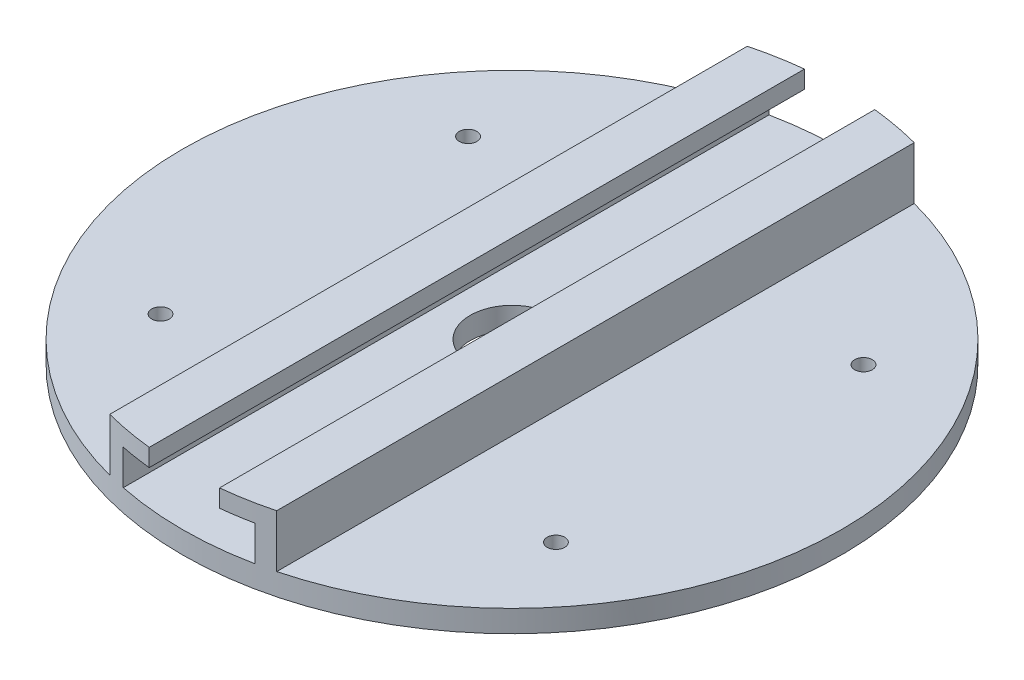
ISO-10303-21;
HEADER;
FILE_DESCRIPTION(('STEP AP214'),'2;1');
FILE_NAME('part.step','',(''),(''),'','','');
FILE_SCHEMA(('AUTOMOTIVE_DESIGN { 1 0 10303 214 1 1 1 1 }'));
ENDSEC;
DATA;
#1=APPLICATION_CONTEXT('core data for automotive mechanical design processes');
#2=APPLICATION_PROTOCOL_DEFINITION('international standard','automotive_design',2000,#1);
#3=PRODUCT_CONTEXT('',#1,'mechanical');
#4=PRODUCT('Part','Part','',(#3));
#5=PRODUCT_RELATED_PRODUCT_CATEGORY('part','',(#4));
#6=PRODUCT_DEFINITION_FORMATION('','',#4);
#7=PRODUCT_DEFINITION_CONTEXT('part definition',#1,'design');
#8=PRODUCT_DEFINITION('design','',#6,#7);
#9=PRODUCT_DEFINITION_SHAPE('','',#8);
#10=(LENGTH_UNIT() NAMED_UNIT(*) SI_UNIT(.MILLI.,.METRE.));
#11=(NAMED_UNIT(*) PLANE_ANGLE_UNIT() SI_UNIT($,.RADIAN.));
#12=(NAMED_UNIT(*) SI_UNIT($,.STERADIAN.) SOLID_ANGLE_UNIT());
#13=UNCERTAINTY_MEASURE_WITH_UNIT(LENGTH_MEASURE(1.E-05),#10,'distance_accuracy_value','');
#14=(GEOMETRIC_REPRESENTATION_CONTEXT(3) GLOBAL_UNCERTAINTY_ASSIGNED_CONTEXT((#13)) GLOBAL_UNIT_ASSIGNED_CONTEXT((#10,
#11,#12)) REPRESENTATION_CONTEXT('',''));
#15=CARTESIAN_POINT('',(0.,0.,0.));
#16=DIRECTION('',(0.,0.,1.));
#17=DIRECTION('',(1.,0.,0.));
#18=AXIS2_PLACEMENT_3D('',#15,#16,#17);
#19=CARTESIAN_POINT('',(0.,5.,0.));
#20=DIRECTION('',(0.,1.,0.));
#21=DIRECTION('',(0.,0.,1.));
#22=AXIS2_PLACEMENT_3D('',#19,#20,#21);
#23=PLANE('',#22);
#24=CARTESIAN_POINT('',(45.,5.,35.));
#25=DIRECTION('',(0.,1.,0.));
#26=DIRECTION('',(0.,0.,1.));
#27=AXIS2_PLACEMENT_3D('',#24,#25,#26);
#28=CIRCLE('',#27,2.);
#29=CARTESIAN_POINT('',(45.,5.,37.));
#30=VERTEX_POINT('',#29);
#31=EDGE_CURVE('E268',#30,#30,#28,.T.);
#32=ORIENTED_EDGE('',*,*,#31,.F.);
#33=EDGE_LOOP('',(#32));
#34=FACE_BOUND('',#33,.T.);
#35=CARTESIAN_POINT('',(45.,5.,-35.));
#36=DIRECTION('',(0.,1.,0.));
#37=DIRECTION('',(0.,0.,1.));
#38=AXIS2_PLACEMENT_3D('',#35,#36,#37);
#39=CIRCLE('',#38,2.);
#40=CARTESIAN_POINT('',(45.,5.,-33.));
#41=VERTEX_POINT('',#40);
#42=EDGE_CURVE('E274',#41,#41,#39,.T.);
#43=ORIENTED_EDGE('',*,*,#42,.F.);
#44=EDGE_LOOP('',(#43));
#45=FACE_BOUND('',#44,.T.);
#46=CARTESIAN_POINT('',(0.,5.,0.));
#47=DIRECTION('',(0.,1.,0.));
#48=DIRECTION('',(0.,0.,1.));
#49=AXIS2_PLACEMENT_3D('',#46,#47,#48);
#50=CIRCLE('',#49,75.);
#51=CARTESIAN_POINT('',(19.,5.,72.5534285888682));
#52=VERTEX_POINT('',#51);
#53=CARTESIAN_POINT('',(19.,5.,-72.5534285888682));
#54=VERTEX_POINT('',#53);
#55=EDGE_CURVE('E45',#52,#54,#50,.T.);
#56=ORIENTED_EDGE('',*,*,#55,.T.);
#57=DIRECTION('',(0.,0.,-1.));
#58=VECTOR('',#57,1.);
#59=CARTESIAN_POINT('',(19.,5.,75.001));
#60=LINE('',#59,#58);
#61=EDGE_CURVE('E53',#52,#54,#60,.T.);
#62=ORIENTED_EDGE('',*,*,#61,.F.);
#63=EDGE_LOOP('',(#56,#62));
#64=FACE_BOUND('',#63,.T.);
#65=ADVANCED_FACE('F35',(#34,#45,#64),#23,.T.);
#66=CARTESIAN_POINT('',(0.,5.,0.));
#67=DIRECTION('',(0.,1.,0.));
#68=DIRECTION('',(0.,0.,1.));
#69=AXIS2_PLACEMENT_3D('',#66,#67,#68);
#70=CIRCLE('',#69,9.5);
#71=CARTESIAN_POINT('',(0.,5.,9.5));
#72=VERTEX_POINT('',#71);
#73=EDGE_CURVE('E250',#72,#72,#70,.T.);
#74=ORIENTED_EDGE('',*,*,#73,.F.);
#75=EDGE_LOOP('',(#74));
#76=FACE_BOUND('',#75,.T.);
#77=CARTESIAN_POINT('',(-15.,5.,73.4846922834954));
#78=VERTEX_POINT('',#77);
#79=CARTESIAN_POINT('',(15.,5.,73.4846922834954));
#80=VERTEX_POINT('',#79);
#81=EDGE_CURVE('E44',#78,#80,#50,.T.);
#82=ORIENTED_EDGE('',*,*,#81,.T.);
#83=DIRECTION('',(0.,0.,-1.));
#84=VECTOR('',#83,1.);
#85=CARTESIAN_POINT('',(15.,5.,75.001));
#86=LINE('',#85,#84);
#87=CARTESIAN_POINT('',(15.,5.,-73.4846922834954));
#88=VERTEX_POINT('',#87);
#89=EDGE_CURVE('E137',#80,#88,#86,.T.);
#90=ORIENTED_EDGE('',*,*,#89,.T.);
#91=CARTESIAN_POINT('',(-15.,5.,-73.4846922834954));
#92=VERTEX_POINT('',#91);
#93=EDGE_CURVE('E122',#88,#92,#50,.T.);
#94=ORIENTED_EDGE('',*,*,#93,.T.);
#95=DIRECTION('',(0.,0.,-1.));
#96=VECTOR('',#95,1.);
#97=CARTESIAN_POINT('',(-15.,5.,75.001));
#98=LINE('',#97,#96);
#99=EDGE_CURVE('E207',#78,#92,#98,.T.);
#100=ORIENTED_EDGE('',*,*,#99,.F.);
#101=EDGE_LOOP('',(#82,#90,#94,#100));
#102=FACE_BOUND('',#101,.T.);
#103=ADVANCED_FACE('F138',(#76,#102),#23,.T.);
#104=CARTESIAN_POINT('',(-45.,5.,35.));
#105=DIRECTION('',(0.,1.,0.));
#106=DIRECTION('',(0.,0.,1.));
#107=AXIS2_PLACEMENT_3D('',#104,#105,#106);
#108=CIRCLE('',#107,2.);
#109=CARTESIAN_POINT('',(-45.,5.,37.));
#110=VERTEX_POINT('',#109);
#111=EDGE_CURVE('E262',#110,#110,#108,.T.);
#112=ORIENTED_EDGE('',*,*,#111,.F.);
#113=EDGE_LOOP('',(#112));
#114=FACE_BOUND('',#113,.T.);
#115=CARTESIAN_POINT('',(-45.,5.,-35.));
#116=DIRECTION('',(0.,1.,0.));
#117=DIRECTION('',(0.,0.,1.));
#118=AXIS2_PLACEMENT_3D('',#115,#116,#117);
#119=CIRCLE('',#118,2.);
#120=CARTESIAN_POINT('',(-45.,5.,-33.));
#121=VERTEX_POINT('',#120);
#122=EDGE_CURVE('E256',#121,#121,#119,.T.);
#123=ORIENTED_EDGE('',*,*,#122,.F.);
#124=EDGE_LOOP('',(#123));
#125=FACE_BOUND('',#124,.T.);
#126=CARTESIAN_POINT('',(-19.,5.,-72.5534285888682));
#127=VERTEX_POINT('',#126);
#128=CARTESIAN_POINT('',(-19.,5.,72.5534285888682));
#129=VERTEX_POINT('',#128);
#130=EDGE_CURVE('E11',#127,#129,#50,.T.);
#131=ORIENTED_EDGE('',*,*,#130,.T.);
#132=DIRECTION('',(0.,0.,-1.));
#133=VECTOR('',#132,1.);
#134=CARTESIAN_POINT('',(-19.,5.,75.001));
#135=LINE('',#134,#133);
#136=EDGE_CURVE('E209',#129,#127,#135,.T.);
#137=ORIENTED_EDGE('',*,*,#136,.T.);
#138=EDGE_LOOP('',(#131,#137));
#139=FACE_BOUND('',#138,.T.);
#140=ADVANCED_FACE('F222',(#114,#125,#139),#23,.T.);
#141=CARTESIAN_POINT('',(0.,5.,0.));
#142=DIRECTION('',(0.,-1.,0.));
#143=DIRECTION('',(0.,0.,-1.));
#144=AXIS2_PLACEMENT_3D('',#141,#142,#143);
#145=CYLINDRICAL_SURFACE('',#144,75.);
#146=ORIENTED_EDGE('',*,*,#130,.F.);
#147=DIRECTION('',(0.,-1.,0.));
#148=VECTOR('',#147,1.);
#149=CARTESIAN_POINT('',(-19.,4.99999999999999,-72.5534285888682));
#150=LINE('',#149,#148);
#151=CARTESIAN_POINT('',(-19.,17.,-72.5534285888682));
#152=VERTEX_POINT('',#151);
#153=EDGE_CURVE('E184',#127,#152,#150,.F.);
#154=ORIENTED_EDGE('',*,*,#153,.T.);
#155=CARTESIAN_POINT('',(0.,17.,0.));
#156=DIRECTION('',(0.,1.,0.));
#157=DIRECTION('',(0.,0.,1.));
#158=AXIS2_PLACEMENT_3D('',#155,#156,#157);
#159=CIRCLE('',#158,75.);
#160=CARTESIAN_POINT('',(-8.,17.,-74.5721127500086));
#161=VERTEX_POINT('',#160);
#162=EDGE_CURVE('E181',#152,#161,#159,.F.);
#163=ORIENTED_EDGE('',*,*,#162,.T.);
#164=DIRECTION('',(0.,-1.,0.));
#165=VECTOR('',#164,1.);
#166=CARTESIAN_POINT('',(-8.,5.,-74.5721127500086));
#167=LINE('',#166,#165);
#168=CARTESIAN_POINT('',(-8.,13.,-74.5721127500086));
#169=VERTEX_POINT('',#168);
#170=EDGE_CURVE('E178',#161,#169,#167,.T.);
#171=ORIENTED_EDGE('',*,*,#170,.T.);
#172=CARTESIAN_POINT('',(0.,13.,0.));
#173=DIRECTION('',(0.,-1.,0.));
#174=DIRECTION('',(0.,0.,-1.));
#175=AXIS2_PLACEMENT_3D('',#172,#173,#174);
#176=CIRCLE('',#175,75.);
#177=CARTESIAN_POINT('',(-15.,13.,-73.4846922834954));
#178=VERTEX_POINT('',#177);
#179=EDGE_CURVE('E176',#169,#178,#176,.F.);
#180=ORIENTED_EDGE('',*,*,#179,.T.);
#181=DIRECTION('',(0.,-1.,0.));
#182=VECTOR('',#181,1.);
#183=CARTESIAN_POINT('',(-15.,5.,-73.4846922834954));
#184=LINE('',#183,#182);
#185=EDGE_CURVE('E132',#92,#178,#184,.F.);
#186=ORIENTED_EDGE('',*,*,#185,.F.);
#187=ORIENTED_EDGE('',*,*,#93,.F.);
#188=DIRECTION('',(0.,-1.,0.));
#189=VECTOR('',#188,1.);
#190=CARTESIAN_POINT('',(15.,4.99999999999999,-73.4846922834954));
#191=LINE('',#190,#189);
#192=CARTESIAN_POINT('',(15.,13.,-73.4846922834954));
#193=VERTEX_POINT('',#192);
#194=EDGE_CURVE('E128',#88,#193,#191,.F.);
#195=ORIENTED_EDGE('',*,*,#194,.T.);
#196=CARTESIAN_POINT('',(0.,13.,0.));
#197=DIRECTION('',(0.,-1.,0.));
#198=DIRECTION('',(0.,0.,-1.));
#199=AXIS2_PLACEMENT_3D('',#196,#197,#198);
#200=CIRCLE('',#199,75.);
#201=CARTESIAN_POINT('',(7.99999999999999,13.,-74.5721127500086));
#202=VERTEX_POINT('',#201);
#203=EDGE_CURVE('E148',#193,#202,#200,.F.);
#204=ORIENTED_EDGE('',*,*,#203,.T.);
#205=DIRECTION('',(0.,-1.,0.));
#206=VECTOR('',#205,1.);
#207=CARTESIAN_POINT('',(7.99999999999999,4.99999999999999,-74.5721127500086));
#208=LINE('',#207,#206);
#209=CARTESIAN_POINT('',(8.,17.,-74.5721127500086));
#210=VERTEX_POINT('',#209);
#211=EDGE_CURVE('E152',#202,#210,#208,.F.);
#212=ORIENTED_EDGE('',*,*,#211,.T.);
#213=CARTESIAN_POINT('',(0.,17.,0.));
#214=DIRECTION('',(0.,1.,0.));
#215=DIRECTION('',(0.,0.,1.));
#216=AXIS2_PLACEMENT_3D('',#213,#214,#215);
#217=CIRCLE('',#216,75.);
#218=CARTESIAN_POINT('',(19.,17.,-72.5534285888682));
#219=VERTEX_POINT('',#218);
#220=EDGE_CURVE('E243',#210,#219,#217,.F.);
#221=ORIENTED_EDGE('',*,*,#220,.T.);
#222=DIRECTION('',(0.,-1.,0.));
#223=VECTOR('',#222,1.);
#224=CARTESIAN_POINT('',(19.,5.,-72.5534285888682));
#225=LINE('',#224,#223);
#226=EDGE_CURVE('E244',#219,#54,#225,.T.);
#227=ORIENTED_EDGE('',*,*,#226,.T.);
#228=ORIENTED_EDGE('',*,*,#55,.F.);
#229=DIRECTION('',(0.,-1.,0.));
#230=VECTOR('',#229,1.);
#231=CARTESIAN_POINT('',(19.,5.,72.5534285888682));
#232=LINE('',#231,#230);
#233=CARTESIAN_POINT('',(19.,17.,72.5534285888682));
#234=VERTEX_POINT('',#233);
#235=EDGE_CURVE('E162',#234,#52,#232,.T.);
#236=ORIENTED_EDGE('',*,*,#235,.F.);
#237=CARTESIAN_POINT('',(0.,17.,0.));
#238=DIRECTION('',(0.,-1.,0.));
#239=DIRECTION('',(0.,0.,-1.));
#240=AXIS2_PLACEMENT_3D('',#237,#238,#239);
#241=CIRCLE('',#240,75.);
#242=CARTESIAN_POINT('',(7.99999999999999,17.,74.5721127500086));
#243=VERTEX_POINT('',#242);
#244=EDGE_CURVE('E159',#243,#234,#241,.F.);
#245=ORIENTED_EDGE('',*,*,#244,.F.);
#246=DIRECTION('',(0.,-1.,0.));
#247=VECTOR('',#246,1.);
#248=CARTESIAN_POINT('',(7.99999999999999,4.99999999999999,74.5721127500086));
#249=LINE('',#248,#247);
#250=CARTESIAN_POINT('',(8.,13.,74.5721127500086));
#251=VERTEX_POINT('',#250);
#252=EDGE_CURVE('E156',#251,#243,#249,.F.);
#253=ORIENTED_EDGE('',*,*,#252,.F.);
#254=CARTESIAN_POINT('',(0.,13.,0.));
#255=DIRECTION('',(0.,1.,0.));
#256=DIRECTION('',(0.,0.,1.));
#257=AXIS2_PLACEMENT_3D('',#254,#255,#256);
#258=CIRCLE('',#257,75.);
#259=CARTESIAN_POINT('',(15.,13.,73.4846922834954));
#260=VERTEX_POINT('',#259);
#261=EDGE_CURVE('E143',#260,#251,#258,.F.);
#262=ORIENTED_EDGE('',*,*,#261,.F.);
#263=DIRECTION('',(0.,-1.,0.));
#264=VECTOR('',#263,1.);
#265=CARTESIAN_POINT('',(15.,4.99999999999999,73.4846922834954));
#266=LINE('',#265,#264);
#267=EDGE_CURVE('E165',#80,#260,#266,.F.);
#268=ORIENTED_EDGE('',*,*,#267,.F.);
#269=ORIENTED_EDGE('',*,*,#81,.F.);
#270=DIRECTION('',(0.,-1.,0.));
#271=VECTOR('',#270,1.);
#272=CARTESIAN_POINT('',(-15.,5.,73.4846922834954));
#273=LINE('',#272,#271);
#274=CARTESIAN_POINT('',(-15.,13.,73.4846922834954));
#275=VERTEX_POINT('',#274);
#276=EDGE_CURVE('E195',#78,#275,#273,.F.);
#277=ORIENTED_EDGE('',*,*,#276,.T.);
#278=CARTESIAN_POINT('',(0.,13.,0.));
#279=DIRECTION('',(0.,1.,0.));
#280=DIRECTION('',(0.,0.,1.));
#281=AXIS2_PLACEMENT_3D('',#278,#279,#280);
#282=CIRCLE('',#281,75.);
#283=CARTESIAN_POINT('',(-8.,13.,74.5721127500086));
#284=VERTEX_POINT('',#283);
#285=EDGE_CURVE('E191',#284,#275,#282,.F.);
#286=ORIENTED_EDGE('',*,*,#285,.F.);
#287=DIRECTION('',(0.,-1.,0.));
#288=VECTOR('',#287,1.);
#289=CARTESIAN_POINT('',(-8.,5.,74.5721127500086));
#290=LINE('',#289,#288);
#291=CARTESIAN_POINT('',(-8.,17.,74.5721127500086));
#292=VERTEX_POINT('',#291);
#293=EDGE_CURVE('E188',#292,#284,#290,.T.);
#294=ORIENTED_EDGE('',*,*,#293,.F.);
#295=CARTESIAN_POINT('',(0.,17.,0.));
#296=DIRECTION('',(0.,-1.,0.));
#297=DIRECTION('',(0.,0.,-1.));
#298=AXIS2_PLACEMENT_3D('',#295,#296,#297);
#299=CIRCLE('',#298,75.);
#300=CARTESIAN_POINT('',(-19.,17.,72.5534285888682));
#301=VERTEX_POINT('',#300);
#302=EDGE_CURVE('E192',#301,#292,#299,.F.);
#303=ORIENTED_EDGE('',*,*,#302,.F.);
#304=DIRECTION('',(0.,-1.,0.));
#305=VECTOR('',#304,1.);
#306=CARTESIAN_POINT('',(-19.,4.99999999999999,72.5534285888682));
#307=LINE('',#306,#305);
#308=EDGE_CURVE('E197',#129,#301,#307,.F.);
#309=ORIENTED_EDGE('',*,*,#308,.F.);
#310=EDGE_LOOP('',(#146,#154,#163,#171,#180,#186,#187,#195,#204,#212,#221,#227,#228,#236,#245,
#253,#262,#268,#269,#277,#286,#294,#303,#309));
#311=FACE_BOUND('',#310,.T.);
#312=CARTESIAN_POINT('',(0.,0.,0.));
#313=DIRECTION('',(0.,1.,0.));
#314=DIRECTION('',(0.,0.,1.));
#315=AXIS2_PLACEMENT_3D('',#312,#313,#314);
#316=CIRCLE('',#315,75.);
#317=CARTESIAN_POINT('',(0.,0.,75.));
#318=VERTEX_POINT('',#317);
#319=EDGE_CURVE('E39',#318,#318,#316,.T.);
#320=ORIENTED_EDGE('',*,*,#319,.T.);
#321=EDGE_LOOP('',(#320));
#322=FACE_BOUND('',#321,.T.);
#323=ADVANCED_FACE('F37',(#311,#322),#145,.T.);
#324=CARTESIAN_POINT('',(0.,0.,0.));
#325=DIRECTION('',(0.,1.,0.));
#326=DIRECTION('',(0.,0.,1.));
#327=AXIS2_PLACEMENT_3D('',#324,#325,#326);
#328=PLANE('',#327);
#329=CARTESIAN_POINT('',(-45.,0.,35.));
#330=DIRECTION('',(0.,1.,0.));
#331=DIRECTION('',(0.,0.,1.));
#332=AXIS2_PLACEMENT_3D('',#329,#330,#331);
#333=CIRCLE('',#332,2.);
#334=CARTESIAN_POINT('',(-45.,0.,37.));
#335=VERTEX_POINT('',#334);
#336=EDGE_CURVE('E265',#335,#335,#333,.T.);
#337=ORIENTED_EDGE('',*,*,#336,.T.);
#338=EDGE_LOOP('',(#337));
#339=FACE_BOUND('',#338,.T.);
#340=CARTESIAN_POINT('',(45.,0.,35.));
#341=DIRECTION('',(0.,1.,0.));
#342=DIRECTION('',(0.,0.,1.));
#343=AXIS2_PLACEMENT_3D('',#340,#341,#342);
#344=CIRCLE('',#343,2.);
#345=CARTESIAN_POINT('',(45.,0.,37.));
#346=VERTEX_POINT('',#345);
#347=EDGE_CURVE('E271',#346,#346,#344,.T.);
#348=ORIENTED_EDGE('',*,*,#347,.T.);
#349=EDGE_LOOP('',(#348));
#350=FACE_BOUND('',#349,.T.);
#351=CARTESIAN_POINT('',(45.,0.,-35.));
#352=DIRECTION('',(0.,1.,0.));
#353=DIRECTION('',(0.,0.,1.));
#354=AXIS2_PLACEMENT_3D('',#351,#352,#353);
#355=CIRCLE('',#354,2.);
#356=CARTESIAN_POINT('',(45.,0.,-33.));
#357=VERTEX_POINT('',#356);
#358=EDGE_CURVE('E259',#357,#357,#355,.T.);
#359=ORIENTED_EDGE('',*,*,#358,.T.);
#360=EDGE_LOOP('',(#359));
#361=FACE_BOUND('',#360,.T.);
#362=CARTESIAN_POINT('',(-45.,0.,-35.));
#363=DIRECTION('',(0.,1.,0.));
#364=DIRECTION('',(0.,0.,1.));
#365=AXIS2_PLACEMENT_3D('',#362,#363,#364);
#366=CIRCLE('',#365,2.);
#367=CARTESIAN_POINT('',(-45.,0.,-33.));
#368=VERTEX_POINT('',#367);
#369=EDGE_CURVE('E253',#368,#368,#366,.T.);
#370=ORIENTED_EDGE('',*,*,#369,.T.);
#371=EDGE_LOOP('',(#370));
#372=FACE_BOUND('',#371,.T.);
#373=CARTESIAN_POINT('',(0.,0.,0.));
#374=DIRECTION('',(0.,1.,0.));
#375=DIRECTION('',(0.,0.,1.));
#376=AXIS2_PLACEMENT_3D('',#373,#374,#375);
#377=CIRCLE('',#376,9.5);
#378=CARTESIAN_POINT('',(0.,0.,9.5));
#379=VERTEX_POINT('',#378);
#380=EDGE_CURVE('E249',#379,#379,#377,.T.);
#381=ORIENTED_EDGE('',*,*,#380,.T.);
#382=EDGE_LOOP('',(#381));
#383=FACE_BOUND('',#382,.T.);
#384=ORIENTED_EDGE('',*,*,#319,.F.);
#385=EDGE_LOOP('',(#384));
#386=FACE_BOUND('',#385,.T.);
#387=ADVANCED_FACE('F280',(#339,#350,#361,#372,#383,#386),#328,.F.);
#388=CARTESIAN_POINT('',(0.,17.,75.001));
#389=DIRECTION('',(0.,-1.,0.));
#390=DIRECTION('',(0.,0.,-1.));
#391=AXIS2_PLACEMENT_3D('',#388,#389,#390);
#392=PLANE('',#391);
#393=DIRECTION('',(0.,0.,-1.));
#394=VECTOR('',#393,1.);
#395=CARTESIAN_POINT('',(-19.,17.,75.001));
#396=LINE('',#395,#394);
#397=EDGE_CURVE('E187',#301,#152,#396,.T.);
#398=ORIENTED_EDGE('',*,*,#397,.F.);
#399=ORIENTED_EDGE('',*,*,#302,.T.);
#400=DIRECTION('',(0.,0.,-1.));
#401=VECTOR('',#400,1.);
#402=CARTESIAN_POINT('',(-8.,17.,75.001));
#403=LINE('',#402,#401);
#404=EDGE_CURVE('E201',#292,#161,#403,.T.);
#405=ORIENTED_EDGE('',*,*,#404,.T.);
#406=ORIENTED_EDGE('',*,*,#162,.F.);
#407=EDGE_LOOP('',(#398,#399,#405,#406));
#408=FACE_BOUND('',#407,.T.);
#409=ADVANCED_FACE('F215',(#408),#392,.F.);
#410=CARTESIAN_POINT('',(-8.,0.,75.001));
#411=DIRECTION('',(-1.,0.,0.));
#412=DIRECTION('',(0.,0.,1.));
#413=AXIS2_PLACEMENT_3D('',#410,#411,#412);
#414=PLANE('',#413);
#415=ORIENTED_EDGE('',*,*,#404,.F.);
#416=ORIENTED_EDGE('',*,*,#293,.T.);
#417=DIRECTION('',(0.,0.,-1.));
#418=VECTOR('',#417,1.);
#419=CARTESIAN_POINT('',(-8.,13.,75.001));
#420=LINE('',#419,#418);
#421=EDGE_CURVE('E203',#284,#169,#420,.T.);
#422=ORIENTED_EDGE('',*,*,#421,.T.);
#423=ORIENTED_EDGE('',*,*,#170,.F.);
#424=EDGE_LOOP('',(#415,#416,#422,#423));
#425=FACE_BOUND('',#424,.T.);
#426=ADVANCED_FACE('F226',(#425),#414,.F.);
#427=CARTESIAN_POINT('',(0.,13.,75.001));
#428=DIRECTION('',(0.,1.,0.));
#429=DIRECTION('',(0.,0.,1.));
#430=AXIS2_PLACEMENT_3D('',#427,#428,#429);
#431=PLANE('',#430);
#432=ORIENTED_EDGE('',*,*,#421,.F.);
#433=ORIENTED_EDGE('',*,*,#285,.T.);
#434=DIRECTION('',(0.,0.,-1.));
#435=VECTOR('',#434,1.);
#436=CARTESIAN_POINT('',(-15.,13.,75.001));
#437=LINE('',#436,#435);
#438=EDGE_CURVE('E205',#275,#178,#437,.T.);
#439=ORIENTED_EDGE('',*,*,#438,.T.);
#440=ORIENTED_EDGE('',*,*,#179,.F.);
#441=EDGE_LOOP('',(#432,#433,#439,#440));
#442=FACE_BOUND('',#441,.T.);
#443=ADVANCED_FACE('F229',(#442),#431,.F.);
#444=CARTESIAN_POINT('',(-15.,0.,75.001));
#445=DIRECTION('',(1.,0.,0.));
#446=DIRECTION('',(0.,1.,0.));
#447=AXIS2_PLACEMENT_3D('',#444,#445,#446);
#448=PLANE('',#447);
#449=ORIENTED_EDGE('',*,*,#276,.F.);
#450=ORIENTED_EDGE('',*,*,#99,.T.);
#451=ORIENTED_EDGE('',*,*,#185,.T.);
#452=ORIENTED_EDGE('',*,*,#438,.F.);
#453=EDGE_LOOP('',(#449,#450,#451,#452));
#454=FACE_BOUND('',#453,.T.);
#455=ADVANCED_FACE('F232',(#454),#448,.T.);
#456=CARTESIAN_POINT('',(-19.,0.,75.001));
#457=DIRECTION('',(1.,0.,0.));
#458=DIRECTION('',(0.,1.,0.));
#459=AXIS2_PLACEMENT_3D('',#456,#457,#458);
#460=PLANE('',#459);
#461=ORIENTED_EDGE('',*,*,#136,.F.);
#462=ORIENTED_EDGE('',*,*,#308,.T.);
#463=ORIENTED_EDGE('',*,*,#397,.T.);
#464=ORIENTED_EDGE('',*,*,#153,.F.);
#465=EDGE_LOOP('',(#461,#462,#463,#464));
#466=FACE_BOUND('',#465,.T.);
#467=ADVANCED_FACE('F220',(#466),#460,.F.);
#468=CARTESIAN_POINT('',(0.,13.,75.001));
#469=DIRECTION('',(0.,1.,0.));
#470=DIRECTION('',(0.,0.,1.));
#471=AXIS2_PLACEMENT_3D('',#468,#469,#470);
#472=PLANE('',#471);
#473=DIRECTION('',(0.,0.,-1.));
#474=VECTOR('',#473,1.);
#475=CARTESIAN_POINT('',(15.,13.,75.001));
#476=LINE('',#475,#474);
#477=EDGE_CURVE('E147',#260,#193,#476,.T.);
#478=ORIENTED_EDGE('',*,*,#477,.F.);
#479=ORIENTED_EDGE('',*,*,#261,.T.);
#480=DIRECTION('',(0.,0.,-1.));
#481=VECTOR('',#480,1.);
#482=CARTESIAN_POINT('',(8.,13.,75.001));
#483=LINE('',#482,#481);
#484=EDGE_CURVE('E150',#251,#202,#483,.T.);
#485=ORIENTED_EDGE('',*,*,#484,.T.);
#486=ORIENTED_EDGE('',*,*,#203,.F.);
#487=EDGE_LOOP('',(#478,#479,#485,#486));
#488=FACE_BOUND('',#487,.T.);
#489=ADVANCED_FACE('F234',(#488),#472,.F.);
#490=CARTESIAN_POINT('',(7.99999999999998,0.,75.001));
#491=DIRECTION('',(1.,0.,0.));
#492=DIRECTION('',(0.,1.,0.));
#493=AXIS2_PLACEMENT_3D('',#490,#491,#492);
#494=PLANE('',#493);
#495=ORIENTED_EDGE('',*,*,#484,.F.);
#496=ORIENTED_EDGE('',*,*,#252,.T.);
#497=DIRECTION('',(0.,0.,-1.));
#498=VECTOR('',#497,1.);
#499=CARTESIAN_POINT('',(8.,17.,75.001));
#500=LINE('',#499,#498);
#501=EDGE_CURVE('E168',#243,#210,#500,.T.);
#502=ORIENTED_EDGE('',*,*,#501,.T.);
#503=ORIENTED_EDGE('',*,*,#211,.F.);
#504=EDGE_LOOP('',(#495,#496,#502,#503));
#505=FACE_BOUND('',#504,.T.);
#506=ADVANCED_FACE('F241',(#505),#494,.F.);
#507=CARTESIAN_POINT('',(0.,17.,75.001));
#508=DIRECTION('',(0.,-1.,0.));
#509=DIRECTION('',(0.,0.,-1.));
#510=AXIS2_PLACEMENT_3D('',#507,#508,#509);
#511=PLANE('',#510);
#512=ORIENTED_EDGE('',*,*,#501,.F.);
#513=ORIENTED_EDGE('',*,*,#244,.T.);
#514=DIRECTION('',(0.,0.,-1.));
#515=VECTOR('',#514,1.);
#516=CARTESIAN_POINT('',(19.,17.,75.001));
#517=LINE('',#516,#515);
#518=EDGE_CURVE('E170',#234,#219,#517,.T.);
#519=ORIENTED_EDGE('',*,*,#518,.T.);
#520=ORIENTED_EDGE('',*,*,#220,.F.);
#521=EDGE_LOOP('',(#512,#513,#519,#520));
#522=FACE_BOUND('',#521,.T.);
#523=ADVANCED_FACE('F329',(#522),#511,.F.);
#524=CARTESIAN_POINT('',(19.,0.,75.001));
#525=DIRECTION('',(-1.,0.,0.));
#526=DIRECTION('',(0.,0.,1.));
#527=AXIS2_PLACEMENT_3D('',#524,#525,#526);
#528=PLANE('',#527);
#529=ORIENTED_EDGE('',*,*,#518,.F.);
#530=ORIENTED_EDGE('',*,*,#235,.T.);
#531=ORIENTED_EDGE('',*,*,#61,.T.);
#532=ORIENTED_EDGE('',*,*,#226,.F.);
#533=EDGE_LOOP('',(#529,#530,#531,#532));
#534=FACE_BOUND('',#533,.T.);
#535=ADVANCED_FACE('F332',(#534),#528,.F.);
#536=CARTESIAN_POINT('',(15.,0.,75.001));
#537=DIRECTION('',(1.,0.,0.));
#538=DIRECTION('',(0.,1.,0.));
#539=AXIS2_PLACEMENT_3D('',#536,#537,#538);
#540=PLANE('',#539);
#541=ORIENTED_EDGE('',*,*,#89,.F.);
#542=ORIENTED_EDGE('',*,*,#267,.T.);
#543=ORIENTED_EDGE('',*,*,#477,.T.);
#544=ORIENTED_EDGE('',*,*,#194,.F.);
#545=EDGE_LOOP('',(#541,#542,#543,#544));
#546=FACE_BOUND('',#545,.T.);
#547=ADVANCED_FACE('F145',(#546),#540,.F.);
#548=CARTESIAN_POINT('',(0.,0.,0.));
#549=DIRECTION('',(0.,1.,0.));
#550=DIRECTION('',(0.,0.,1.));
#551=AXIS2_PLACEMENT_3D('',#548,#549,#550);
#552=CYLINDRICAL_SURFACE('',#551,9.5);
#553=ORIENTED_EDGE('',*,*,#380,.F.);
#554=EDGE_LOOP('',(#553));
#555=FACE_BOUND('',#554,.T.);
#556=ORIENTED_EDGE('',*,*,#73,.T.);
#557=EDGE_LOOP('',(#556));
#558=FACE_BOUND('',#557,.T.);
#559=ADVANCED_FACE('F312',(#555,#558),#552,.F.);
#560=CARTESIAN_POINT('',(-45.,0.,-35.));
#561=DIRECTION('',(0.,1.,0.));
#562=DIRECTION('',(0.,0.,1.));
#563=AXIS2_PLACEMENT_3D('',#560,#561,#562);
#564=CYLINDRICAL_SURFACE('',#563,2.);
#565=ORIENTED_EDGE('',*,*,#369,.F.);
#566=EDGE_LOOP('',(#565));
#567=FACE_BOUND('',#566,.T.);
#568=ORIENTED_EDGE('',*,*,#122,.T.);
#569=EDGE_LOOP('',(#568));
#570=FACE_BOUND('',#569,.T.);
#571=ADVANCED_FACE('F287',(#567,#570),#564,.F.);
#572=CARTESIAN_POINT('',(45.,0.,-35.));
#573=DIRECTION('',(0.,1.,0.));
#574=DIRECTION('',(0.,0.,1.));
#575=AXIS2_PLACEMENT_3D('',#572,#573,#574);
#576=CYLINDRICAL_SURFACE('',#575,2.);
#577=ORIENTED_EDGE('',*,*,#358,.F.);
#578=EDGE_LOOP('',(#577));
#579=FACE_BOUND('',#578,.T.);
#580=ORIENTED_EDGE('',*,*,#42,.T.);
#581=EDGE_LOOP('',(#580));
#582=FACE_BOUND('',#581,.T.);
#583=ADVANCED_FACE('F283',(#579,#582),#576,.F.);
#584=CARTESIAN_POINT('',(45.,0.,35.));
#585=DIRECTION('',(0.,1.,0.));
#586=DIRECTION('',(0.,0.,1.));
#587=AXIS2_PLACEMENT_3D('',#584,#585,#586);
#588=CYLINDRICAL_SURFACE('',#587,2.);
#589=ORIENTED_EDGE('',*,*,#347,.F.);
#590=EDGE_LOOP('',(#589));
#591=FACE_BOUND('',#590,.T.);
#592=ORIENTED_EDGE('',*,*,#31,.T.);
#593=EDGE_LOOP('',(#592));
#594=FACE_BOUND('',#593,.T.);
#595=ADVANCED_FACE('F286',(#591,#594),#588,.F.);
#596=CARTESIAN_POINT('',(-45.,0.,35.));
#597=DIRECTION('',(0.,1.,0.));
#598=DIRECTION('',(0.,0.,1.));
#599=AXIS2_PLACEMENT_3D('',#596,#597,#598);
#600=CYLINDRICAL_SURFACE('',#599,2.);
#601=ORIENTED_EDGE('',*,*,#336,.F.);
#602=EDGE_LOOP('',(#601));
#603=FACE_BOUND('',#602,.T.);
#604=ORIENTED_EDGE('',*,*,#111,.T.);
#605=EDGE_LOOP('',(#604));
#606=FACE_BOUND('',#605,.T.);
#607=ADVANCED_FACE('F322',(#603,#606),#600,.F.);
#608=CLOSED_SHELL('',(#65,#103,#140,#323,#387,#409,#426,#443,#455,#467,#489,#506,#523,#535,#547,
#559,#571,#583,#595,#607));
#609=MANIFOLD_SOLID_BREP('B2',#608);
#610=ADVANCED_BREP_SHAPE_REPRESENTATION('',(#18,#609),#14);
#611=SHAPE_DEFINITION_REPRESENTATION(#9,#610);
ENDSEC;
END-ISO-10303-21;
